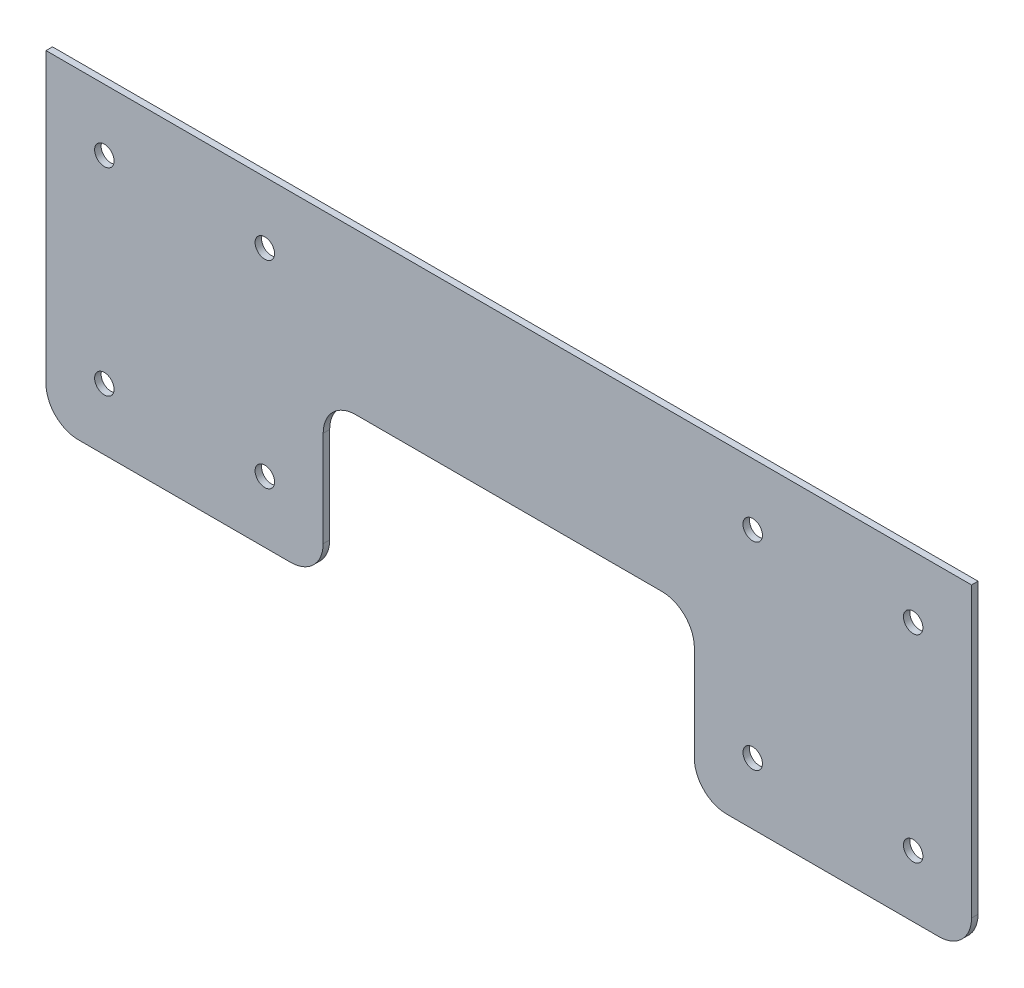
ISO-10303-21;
HEADER;
FILE_DESCRIPTION(('STEP AP214'),'2;1');
FILE_NAME('part.step','',(''),(''),'','','');
FILE_SCHEMA(('AUTOMOTIVE_DESIGN { 1 0 10303 214 1 1 1 1 }'));
ENDSEC;
DATA;
#1=APPLICATION_CONTEXT('core data for automotive mechanical design processes');
#2=APPLICATION_PROTOCOL_DEFINITION('international standard','automotive_design',2000,#1);
#3=PRODUCT_CONTEXT('',#1,'mechanical');
#4=PRODUCT('Part','Part','',(#3));
#5=PRODUCT_RELATED_PRODUCT_CATEGORY('part','',(#4));
#6=PRODUCT_DEFINITION_FORMATION('','',#4);
#7=PRODUCT_DEFINITION_CONTEXT('part definition',#1,'design');
#8=PRODUCT_DEFINITION('design','',#6,#7);
#9=PRODUCT_DEFINITION_SHAPE('','',#8);
#10=(LENGTH_UNIT() NAMED_UNIT(*) SI_UNIT(.MILLI.,.METRE.));
#11=(NAMED_UNIT(*) PLANE_ANGLE_UNIT() SI_UNIT($,.RADIAN.));
#12=(NAMED_UNIT(*) SI_UNIT($,.STERADIAN.) SOLID_ANGLE_UNIT());
#13=UNCERTAINTY_MEASURE_WITH_UNIT(LENGTH_MEASURE(1.E-05),#10,'distance_accuracy_value','');
#14=(GEOMETRIC_REPRESENTATION_CONTEXT(3) GLOBAL_UNCERTAINTY_ASSIGNED_CONTEXT((#13)) GLOBAL_UNIT_ASSIGNED_CONTEXT((#10,
#11,#12)) REPRESENTATION_CONTEXT('',''));
#15=CARTESIAN_POINT('',(0.,0.,0.));
#16=DIRECTION('',(0.,0.,1.));
#17=DIRECTION('',(1.,0.,0.));
#18=AXIS2_PLACEMENT_3D('',#15,#16,#17);
#19=CARTESIAN_POINT('',(132.75,-39.5,2.));
#20=DIRECTION('',(0.,0.,-1.));
#21=DIRECTION('',(-1.,0.,0.));
#22=AXIS2_PLACEMENT_3D('',#19,#20,#21);
#23=PLANE('',#22);
#24=DIRECTION('',(-1.,0.,0.));
#25=VECTOR('',#24,1.);
#26=CARTESIAN_POINT('',(-142.75,49.5,2.));
#27=LINE('',#26,#25);
#28=CARTESIAN_POINT('',(142.75,49.5,2.));
#29=VERTEX_POINT('',#28);
#30=CARTESIAN_POINT('',(-142.75,49.5,2.));
#31=VERTEX_POINT('',#30);
#32=EDGE_CURVE('E192',#29,#31,#27,.T.);
#33=ORIENTED_EDGE('',*,*,#32,.T.);
#34=DIRECTION('',(0.,-1.,0.));
#35=VECTOR('',#34,1.);
#36=CARTESIAN_POINT('',(-142.75,49.5,2.));
#37=LINE('',#36,#35);
#38=CARTESIAN_POINT('',(-142.75,-39.4999999999999,2.));
#39=VERTEX_POINT('',#38);
#40=EDGE_CURVE('E110',#31,#39,#37,.T.);
#41=ORIENTED_EDGE('',*,*,#40,.T.);
#42=CARTESIAN_POINT('',(-132.75,-39.5,2.));
#43=DIRECTION('',(0.,0.,1.));
#44=DIRECTION('',(1.,0.,0.));
#45=AXIS2_PLACEMENT_3D('',#42,#43,#44);
#46=CIRCLE('',#45,10.);
#47=CARTESIAN_POINT('',(-132.75,-49.5,2.));
#48=VERTEX_POINT('',#47);
#49=EDGE_CURVE('E225',#39,#48,#46,.T.);
#50=ORIENTED_EDGE('',*,*,#49,.T.);
#51=DIRECTION('',(1.,0.,0.));
#52=VECTOR('',#51,1.);
#53=CARTESIAN_POINT('',(-132.75,-49.5,2.));
#54=LINE('',#53,#52);
#55=CARTESIAN_POINT('',(-67.2500000000001,-49.5,2.));
#56=VERTEX_POINT('',#55);
#57=EDGE_CURVE('E244',#48,#56,#54,.T.);
#58=ORIENTED_EDGE('',*,*,#57,.T.);
#59=CARTESIAN_POINT('',(-67.25,-39.5,2.));
#60=DIRECTION('',(0.,0.,1.));
#61=DIRECTION('',(1.,0.,0.));
#62=AXIS2_PLACEMENT_3D('',#59,#60,#61);
#63=CIRCLE('',#62,10.);
#64=CARTESIAN_POINT('',(-57.25,-39.5,2.));
#65=VERTEX_POINT('',#64);
#66=EDGE_CURVE('E241',#56,#65,#63,.T.);
#67=ORIENTED_EDGE('',*,*,#66,.T.);
#68=DIRECTION('',(0.,1.,0.));
#69=VECTOR('',#68,1.);
#70=CARTESIAN_POINT('',(-57.25,-39.4999999999999,2.));
#71=LINE('',#70,#69);
#72=CARTESIAN_POINT('',(-57.25,-10.0000000000001,2.));
#73=VERTEX_POINT('',#72);
#74=EDGE_CURVE('E243',#65,#73,#71,.T.);
#75=ORIENTED_EDGE('',*,*,#74,.T.);
#76=CARTESIAN_POINT('',(-47.25,-10.,2.));
#77=DIRECTION('',(0.,0.,-1.));
#78=DIRECTION('',(-1.,0.,0.));
#79=AXIS2_PLACEMENT_3D('',#76,#77,#78);
#80=CIRCLE('',#79,10.);
#81=CARTESIAN_POINT('',(-47.2499999999999,0.,2.));
#82=VERTEX_POINT('',#81);
#83=EDGE_CURVE('E246',#73,#82,#80,.T.);
#84=ORIENTED_EDGE('',*,*,#83,.T.);
#85=DIRECTION('',(1.,0.,0.));
#86=VECTOR('',#85,1.);
#87=CARTESIAN_POINT('',(-47.2499999999999,0.,2.));
#88=LINE('',#87,#86);
#89=CARTESIAN_POINT('',(47.2499999999999,0.,2.));
#90=VERTEX_POINT('',#89);
#91=EDGE_CURVE('E252',#82,#90,#88,.T.);
#92=ORIENTED_EDGE('',*,*,#91,.T.);
#93=CARTESIAN_POINT('',(47.25,-10.,2.));
#94=DIRECTION('',(0.,0.,-1.));
#95=DIRECTION('',(-1.,0.,0.));
#96=AXIS2_PLACEMENT_3D('',#93,#94,#95);
#97=CIRCLE('',#96,10.);
#98=CARTESIAN_POINT('',(57.25,-10.0000000000001,2.));
#99=VERTEX_POINT('',#98);
#100=EDGE_CURVE('E254',#90,#99,#97,.T.);
#101=ORIENTED_EDGE('',*,*,#100,.T.);
#102=DIRECTION('',(0.,-1.,0.));
#103=VECTOR('',#102,1.);
#104=CARTESIAN_POINT('',(57.25,-10.0000000000001,2.));
#105=LINE('',#104,#103);
#106=CARTESIAN_POINT('',(57.25,-39.4999999999999,2.));
#107=VERTEX_POINT('',#106);
#108=EDGE_CURVE('E256',#99,#107,#105,.T.);
#109=ORIENTED_EDGE('',*,*,#108,.T.);
#110=CARTESIAN_POINT('',(67.25,-39.5,2.));
#111=DIRECTION('',(0.,0.,1.));
#112=DIRECTION('',(1.,0.,0.));
#113=AXIS2_PLACEMENT_3D('',#110,#111,#112);
#114=CIRCLE('',#113,9.99999999999999);
#115=CARTESIAN_POINT('',(67.2500000000001,-49.5,2.));
#116=VERTEX_POINT('',#115);
#117=EDGE_CURVE('E147',#107,#116,#114,.T.);
#118=ORIENTED_EDGE('',*,*,#117,.T.);
#119=DIRECTION('',(1.,0.,0.));
#120=VECTOR('',#119,1.);
#121=CARTESIAN_POINT('',(132.75,-49.5,2.));
#122=LINE('',#121,#120);
#123=CARTESIAN_POINT('',(132.75,-49.5,2.));
#124=VERTEX_POINT('',#123);
#125=EDGE_CURVE('E141',#116,#124,#122,.T.);
#126=ORIENTED_EDGE('',*,*,#125,.T.);
#127=CARTESIAN_POINT('',(132.75,-39.5,2.));
#128=DIRECTION('',(0.,0.,1.));
#129=DIRECTION('',(-1.,0.,0.));
#130=AXIS2_PLACEMENT_3D('',#127,#128,#129);
#131=CIRCLE('',#130,10.);
#132=CARTESIAN_POINT('',(142.75,-39.4999999999999,2.));
#133=VERTEX_POINT('',#132);
#134=EDGE_CURVE('E145',#124,#133,#131,.T.);
#135=ORIENTED_EDGE('',*,*,#134,.T.);
#136=DIRECTION('',(0.,1.,0.));
#137=VECTOR('',#136,1.);
#138=CARTESIAN_POINT('',(142.75,49.5,2.));
#139=LINE('',#138,#137);
#140=EDGE_CURVE('E49',#133,#29,#139,.T.);
#141=ORIENTED_EDGE('',*,*,#140,.T.);
#142=EDGE_LOOP('',(#33,#41,#50,#58,#67,#75,#84,#92,#101,#109,#118,#126,#135,#141));
#143=FACE_BOUND('',#142,.T.);
#144=CARTESIAN_POINT('',(124.75,30.5,2.));
#145=DIRECTION('',(0.,0.,1.));
#146=DIRECTION('',(1.,0.,0.));
#147=AXIS2_PLACEMENT_3D('',#144,#145,#146);
#148=CIRCLE('',#147,2.99999999999998);
#149=CARTESIAN_POINT('',(127.75,30.5,2.));
#150=VERTEX_POINT('',#149);
#151=EDGE_CURVE('E169',#150,#150,#148,.T.);
#152=ORIENTED_EDGE('',*,*,#151,.F.);
#153=EDGE_LOOP('',(#152));
#154=FACE_BOUND('',#153,.T.);
#155=CARTESIAN_POINT('',(124.75,-30.5,2.));
#156=DIRECTION('',(0.,0.,1.));
#157=DIRECTION('',(1.,0.,0.));
#158=AXIS2_PLACEMENT_3D('',#155,#156,#157);
#159=CIRCLE('',#158,2.99999999999997);
#160=CARTESIAN_POINT('',(127.75,-30.5,2.));
#161=VERTEX_POINT('',#160);
#162=EDGE_CURVE('E360',#161,#161,#159,.T.);
#163=ORIENTED_EDGE('',*,*,#162,.F.);
#164=EDGE_LOOP('',(#163));
#165=FACE_BOUND('',#164,.T.);
#166=CARTESIAN_POINT('',(-75.25,-30.5,2.));
#167=DIRECTION('',(0.,0.,1.));
#168=DIRECTION('',(1.,0.,0.));
#169=AXIS2_PLACEMENT_3D('',#166,#167,#168);
#170=CIRCLE('',#169,2.99999999999999);
#171=CARTESIAN_POINT('',(-72.25,-30.5,2.));
#172=VERTEX_POINT('',#171);
#173=EDGE_CURVE('E354',#172,#172,#170,.T.);
#174=ORIENTED_EDGE('',*,*,#173,.F.);
#175=EDGE_LOOP('',(#174));
#176=FACE_BOUND('',#175,.T.);
#177=CARTESIAN_POINT('',(-75.25,30.5,2.));
#178=DIRECTION('',(0.,0.,1.));
#179=DIRECTION('',(1.,0.,0.));
#180=AXIS2_PLACEMENT_3D('',#177,#178,#179);
#181=CIRCLE('',#180,2.99999999999999);
#182=CARTESIAN_POINT('',(-72.25,30.5,2.));
#183=VERTEX_POINT('',#182);
#184=EDGE_CURVE('E348',#183,#183,#181,.T.);
#185=ORIENTED_EDGE('',*,*,#184,.F.);
#186=EDGE_LOOP('',(#185));
#187=FACE_BOUND('',#186,.T.);
#188=CARTESIAN_POINT('',(75.25,-30.5,2.));
#189=DIRECTION('',(0.,0.,1.));
#190=DIRECTION('',(-1.,0.,0.));
#191=AXIS2_PLACEMENT_3D('',#188,#189,#190);
#192=CIRCLE('',#191,2.99999999999999);
#193=CARTESIAN_POINT('',(72.25,-30.5,2.));
#194=VERTEX_POINT('',#193);
#195=EDGE_CURVE('E342',#194,#194,#192,.T.);
#196=ORIENTED_EDGE('',*,*,#195,.F.);
#197=EDGE_LOOP('',(#196));
#198=FACE_BOUND('',#197,.T.);
#199=CARTESIAN_POINT('',(75.25,30.5,2.));
#200=DIRECTION('',(0.,0.,1.));
#201=DIRECTION('',(-1.,0.,0.));
#202=AXIS2_PLACEMENT_3D('',#199,#200,#201);
#203=CIRCLE('',#202,2.99999999999999);
#204=CARTESIAN_POINT('',(72.25,30.5,2.));
#205=VERTEX_POINT('',#204);
#206=EDGE_CURVE('E336',#205,#205,#203,.T.);
#207=ORIENTED_EDGE('',*,*,#206,.F.);
#208=EDGE_LOOP('',(#207));
#209=FACE_BOUND('',#208,.T.);
#210=CARTESIAN_POINT('',(-124.75,30.5,2.));
#211=DIRECTION('',(0.,0.,1.));
#212=DIRECTION('',(-1.,0.,0.));
#213=AXIS2_PLACEMENT_3D('',#210,#211,#212);
#214=CIRCLE('',#213,2.99999999999998);
#215=CARTESIAN_POINT('',(-127.75,30.5,2.));
#216=VERTEX_POINT('',#215);
#217=EDGE_CURVE('E330',#216,#216,#214,.T.);
#218=ORIENTED_EDGE('',*,*,#217,.F.);
#219=EDGE_LOOP('',(#218));
#220=FACE_BOUND('',#219,.T.);
#221=CARTESIAN_POINT('',(-124.75,-30.5,2.));
#222=DIRECTION('',(0.,0.,1.));
#223=DIRECTION('',(-1.,0.,0.));
#224=AXIS2_PLACEMENT_3D('',#221,#222,#223);
#225=CIRCLE('',#224,2.99999999999997);
#226=CARTESIAN_POINT('',(-127.75,-30.5,2.));
#227=VERTEX_POINT('',#226);
#228=EDGE_CURVE('E321',#227,#227,#225,.T.);
#229=ORIENTED_EDGE('',*,*,#228,.F.);
#230=EDGE_LOOP('',(#229));
#231=FACE_BOUND('',#230,.T.);
#232=ADVANCED_FACE('F32',(#143,#154,#165,#176,#187,#198,#209,#220,#231),#23,.F.);
#233=CARTESIAN_POINT('',(132.75,-39.5,0.));
#234=DIRECTION('',(0.,0.,-1.));
#235=DIRECTION('',(-1.,0.,0.));
#236=AXIS2_PLACEMENT_3D('',#233,#234,#235);
#237=PLANE('',#236);
#238=CARTESIAN_POINT('',(-124.75,30.5,0.));
#239=DIRECTION('',(0.,0.,1.));
#240=DIRECTION('',(-1.,0.,0.));
#241=AXIS2_PLACEMENT_3D('',#238,#239,#240);
#242=CIRCLE('',#241,2.99999999999998);
#243=CARTESIAN_POINT('',(-127.75,30.5,0.));
#244=VERTEX_POINT('',#243);
#245=EDGE_CURVE('E327',#244,#244,#242,.T.);
#246=ORIENTED_EDGE('',*,*,#245,.T.);
#247=EDGE_LOOP('',(#246));
#248=FACE_BOUND('',#247,.T.);
#249=CARTESIAN_POINT('',(75.25,-30.5,0.));
#250=DIRECTION('',(0.,0.,1.));
#251=DIRECTION('',(-1.,0.,0.));
#252=AXIS2_PLACEMENT_3D('',#249,#250,#251);
#253=CIRCLE('',#252,2.99999999999999);
#254=CARTESIAN_POINT('',(72.25,-30.5,0.));
#255=VERTEX_POINT('',#254);
#256=EDGE_CURVE('E339',#255,#255,#253,.T.);
#257=ORIENTED_EDGE('',*,*,#256,.T.);
#258=EDGE_LOOP('',(#257));
#259=FACE_BOUND('',#258,.T.);
#260=CARTESIAN_POINT('',(-75.25,-30.5,0.));
#261=DIRECTION('',(0.,0.,1.));
#262=DIRECTION('',(1.,0.,0.));
#263=AXIS2_PLACEMENT_3D('',#260,#261,#262);
#264=CIRCLE('',#263,2.99999999999999);
#265=CARTESIAN_POINT('',(-72.25,-30.5,0.));
#266=VERTEX_POINT('',#265);
#267=EDGE_CURVE('E351',#266,#266,#264,.T.);
#268=ORIENTED_EDGE('',*,*,#267,.T.);
#269=EDGE_LOOP('',(#268));
#270=FACE_BOUND('',#269,.T.);
#271=CARTESIAN_POINT('',(124.75,30.5,0.));
#272=DIRECTION('',(0.,0.,1.));
#273=DIRECTION('',(1.,0.,0.));
#274=AXIS2_PLACEMENT_3D('',#271,#272,#273);
#275=CIRCLE('',#274,2.99999999999998);
#276=CARTESIAN_POINT('',(127.75,30.5,0.));
#277=VERTEX_POINT('',#276);
#278=EDGE_CURVE('E363',#277,#277,#275,.T.);
#279=ORIENTED_EDGE('',*,*,#278,.T.);
#280=EDGE_LOOP('',(#279));
#281=FACE_BOUND('',#280,.T.);
#282=DIRECTION('',(-1.,0.,0.));
#283=VECTOR('',#282,1.);
#284=CARTESIAN_POINT('',(-142.75,49.5,0.));
#285=LINE('',#284,#283);
#286=CARTESIAN_POINT('',(142.75,49.5,0.));
#287=VERTEX_POINT('',#286);
#288=CARTESIAN_POINT('',(-142.75,49.5,0.));
#289=VERTEX_POINT('',#288);
#290=EDGE_CURVE('E165',#287,#289,#285,.T.);
#291=ORIENTED_EDGE('',*,*,#290,.F.);
#292=DIRECTION('',(0.,1.,0.));
#293=VECTOR('',#292,1.);
#294=CARTESIAN_POINT('',(142.75,49.5,0.));
#295=LINE('',#294,#293);
#296=CARTESIAN_POINT('',(142.75,-39.4999999999999,0.));
#297=VERTEX_POINT('',#296);
#298=EDGE_CURVE('E102',#297,#287,#295,.T.);
#299=ORIENTED_EDGE('',*,*,#298,.F.);
#300=CARTESIAN_POINT('',(132.75,-39.5,0.));
#301=DIRECTION('',(0.,0.,1.));
#302=DIRECTION('',(-1.,0.,0.));
#303=AXIS2_PLACEMENT_3D('',#300,#301,#302);
#304=CIRCLE('',#303,10.);
#305=CARTESIAN_POINT('',(132.75,-49.5,0.));
#306=VERTEX_POINT('',#305);
#307=EDGE_CURVE('E96',#306,#297,#304,.T.);
#308=ORIENTED_EDGE('',*,*,#307,.F.);
#309=DIRECTION('',(1.,0.,0.));
#310=VECTOR('',#309,1.);
#311=CARTESIAN_POINT('',(132.75,-49.5,0.));
#312=LINE('',#311,#310);
#313=CARTESIAN_POINT('',(67.2500000000001,-49.5,0.));
#314=VERTEX_POINT('',#313);
#315=EDGE_CURVE('E155',#314,#306,#312,.T.);
#316=ORIENTED_EDGE('',*,*,#315,.F.);
#317=CARTESIAN_POINT('',(67.25,-39.5,0.));
#318=DIRECTION('',(0.,0.,1.));
#319=DIRECTION('',(1.,0.,0.));
#320=AXIS2_PLACEMENT_3D('',#317,#318,#319);
#321=CIRCLE('',#320,9.99999999999999);
#322=CARTESIAN_POINT('',(57.25,-39.4999999999999,0.));
#323=VERTEX_POINT('',#322);
#324=EDGE_CURVE('E187',#323,#314,#321,.T.);
#325=ORIENTED_EDGE('',*,*,#324,.F.);
#326=DIRECTION('',(0.,-1.,0.));
#327=VECTOR('',#326,1.);
#328=CARTESIAN_POINT('',(57.25,-10.0000000000001,0.));
#329=LINE('',#328,#327);
#330=CARTESIAN_POINT('',(57.25,-10.0000000000001,0.));
#331=VERTEX_POINT('',#330);
#332=EDGE_CURVE('E185',#331,#323,#329,.T.);
#333=ORIENTED_EDGE('',*,*,#332,.F.);
#334=CARTESIAN_POINT('',(47.25,-10.,0.));
#335=DIRECTION('',(0.,0.,-1.));
#336=DIRECTION('',(-1.,0.,0.));
#337=AXIS2_PLACEMENT_3D('',#334,#335,#336);
#338=CIRCLE('',#337,10.);
#339=CARTESIAN_POINT('',(47.2499999999999,0.,0.));
#340=VERTEX_POINT('',#339);
#341=EDGE_CURVE('E183',#340,#331,#338,.T.);
#342=ORIENTED_EDGE('',*,*,#341,.F.);
#343=DIRECTION('',(1.,0.,0.));
#344=VECTOR('',#343,1.);
#345=CARTESIAN_POINT('',(-47.2499999999999,0.,0.));
#346=LINE('',#345,#344);
#347=CARTESIAN_POINT('',(-47.2499999999999,0.,0.));
#348=VERTEX_POINT('',#347);
#349=EDGE_CURVE('E181',#348,#340,#346,.T.);
#350=ORIENTED_EDGE('',*,*,#349,.F.);
#351=CARTESIAN_POINT('',(-47.25,-10.,0.));
#352=DIRECTION('',(0.,0.,-1.));
#353=DIRECTION('',(-1.,0.,0.));
#354=AXIS2_PLACEMENT_3D('',#351,#352,#353);
#355=CIRCLE('',#354,10.);
#356=CARTESIAN_POINT('',(-57.25,-10.0000000000001,0.));
#357=VERTEX_POINT('',#356);
#358=EDGE_CURVE('E179',#357,#348,#355,.T.);
#359=ORIENTED_EDGE('',*,*,#358,.F.);
#360=DIRECTION('',(0.,1.,0.));
#361=VECTOR('',#360,1.);
#362=CARTESIAN_POINT('',(-57.25,-39.4999999999999,0.));
#363=LINE('',#362,#361);
#364=CARTESIAN_POINT('',(-57.25,-39.5,0.));
#365=VERTEX_POINT('',#364);
#366=EDGE_CURVE('E177',#365,#357,#363,.T.);
#367=ORIENTED_EDGE('',*,*,#366,.F.);
#368=CARTESIAN_POINT('',(-67.25,-39.5,0.));
#369=DIRECTION('',(0.,0.,1.));
#370=DIRECTION('',(1.,0.,0.));
#371=AXIS2_PLACEMENT_3D('',#368,#369,#370);
#372=CIRCLE('',#371,10.);
#373=CARTESIAN_POINT('',(-67.2500000000001,-49.5,0.));
#374=VERTEX_POINT('',#373);
#375=EDGE_CURVE('E175',#374,#365,#372,.T.);
#376=ORIENTED_EDGE('',*,*,#375,.F.);
#377=DIRECTION('',(1.,0.,0.));
#378=VECTOR('',#377,1.);
#379=CARTESIAN_POINT('',(-132.75,-49.5,0.));
#380=LINE('',#379,#378);
#381=CARTESIAN_POINT('',(-132.75,-49.5,0.));
#382=VERTEX_POINT('',#381);
#383=EDGE_CURVE('E173',#382,#374,#380,.T.);
#384=ORIENTED_EDGE('',*,*,#383,.F.);
#385=CARTESIAN_POINT('',(-132.75,-39.5,0.));
#386=DIRECTION('',(0.,0.,1.));
#387=DIRECTION('',(1.,0.,0.));
#388=AXIS2_PLACEMENT_3D('',#385,#386,#387);
#389=CIRCLE('',#388,10.);
#390=CARTESIAN_POINT('',(-142.75,-39.4999999999999,0.));
#391=VERTEX_POINT('',#390);
#392=EDGE_CURVE('E171',#391,#382,#389,.T.);
#393=ORIENTED_EDGE('',*,*,#392,.F.);
#394=DIRECTION('',(0.,-1.,0.));
#395=VECTOR('',#394,1.);
#396=CARTESIAN_POINT('',(-142.75,49.5,0.));
#397=LINE('',#396,#395);
#398=EDGE_CURVE('E168',#289,#391,#397,.T.);
#399=ORIENTED_EDGE('',*,*,#398,.F.);
#400=EDGE_LOOP('',(#291,#299,#308,#316,#325,#333,#342,#350,#359,#367,#376,#384,#393,#399));
#401=FACE_BOUND('',#400,.T.);
#402=CARTESIAN_POINT('',(124.75,-30.5,0.));
#403=DIRECTION('',(0.,0.,1.));
#404=DIRECTION('',(1.,0.,0.));
#405=AXIS2_PLACEMENT_3D('',#402,#403,#404);
#406=CIRCLE('',#405,2.99999999999997);
#407=CARTESIAN_POINT('',(127.75,-30.5,0.));
#408=VERTEX_POINT('',#407);
#409=EDGE_CURVE('E357',#408,#408,#406,.T.);
#410=ORIENTED_EDGE('',*,*,#409,.T.);
#411=EDGE_LOOP('',(#410));
#412=FACE_BOUND('',#411,.T.);
#413=CARTESIAN_POINT('',(-75.25,30.5,0.));
#414=DIRECTION('',(0.,0.,1.));
#415=DIRECTION('',(1.,0.,0.));
#416=AXIS2_PLACEMENT_3D('',#413,#414,#415);
#417=CIRCLE('',#416,2.99999999999999);
#418=CARTESIAN_POINT('',(-72.25,30.5,0.));
#419=VERTEX_POINT('',#418);
#420=EDGE_CURVE('E345',#419,#419,#417,.T.);
#421=ORIENTED_EDGE('',*,*,#420,.T.);
#422=EDGE_LOOP('',(#421));
#423=FACE_BOUND('',#422,.T.);
#424=CARTESIAN_POINT('',(75.25,30.5,0.));
#425=DIRECTION('',(0.,0.,1.));
#426=DIRECTION('',(-1.,0.,0.));
#427=AXIS2_PLACEMENT_3D('',#424,#425,#426);
#428=CIRCLE('',#427,2.99999999999999);
#429=CARTESIAN_POINT('',(72.25,30.5,0.));
#430=VERTEX_POINT('',#429);
#431=EDGE_CURVE('E333',#430,#430,#428,.T.);
#432=ORIENTED_EDGE('',*,*,#431,.T.);
#433=EDGE_LOOP('',(#432));
#434=FACE_BOUND('',#433,.T.);
#435=CARTESIAN_POINT('',(-124.75,-30.5,0.));
#436=DIRECTION('',(0.,0.,1.));
#437=DIRECTION('',(-1.,0.,0.));
#438=AXIS2_PLACEMENT_3D('',#435,#436,#437);
#439=CIRCLE('',#438,2.99999999999997);
#440=CARTESIAN_POINT('',(-127.75,-30.5,0.));
#441=VERTEX_POINT('',#440);
#442=EDGE_CURVE('E324',#441,#441,#439,.T.);
#443=ORIENTED_EDGE('',*,*,#442,.T.);
#444=EDGE_LOOP('',(#443));
#445=FACE_BOUND('',#444,.T.);
#446=ADVANCED_FACE('F229',(#248,#259,#270,#281,#401,#412,#423,#434,#445),#237,.T.);
#447=CARTESIAN_POINT('',(-142.75,49.5,2.));
#448=DIRECTION('',(0.,-1.,0.));
#449=DIRECTION('',(1.,0.,0.));
#450=AXIS2_PLACEMENT_3D('',#447,#448,#449);
#451=PLANE('',#450);
#452=ORIENTED_EDGE('',*,*,#290,.T.);
#453=DIRECTION('',(0.,0.,-1.));
#454=VECTOR('',#453,1.);
#455=CARTESIAN_POINT('',(-142.75,49.5,2.));
#456=LINE('',#455,#454);
#457=EDGE_CURVE('E11',#31,#289,#456,.T.);
#458=ORIENTED_EDGE('',*,*,#457,.F.);
#459=ORIENTED_EDGE('',*,*,#32,.F.);
#460=DIRECTION('',(0.,0.,-1.));
#461=VECTOR('',#460,1.);
#462=CARTESIAN_POINT('',(142.75,49.5,2.));
#463=LINE('',#462,#461);
#464=EDGE_CURVE('E161',#29,#287,#463,.T.);
#465=ORIENTED_EDGE('',*,*,#464,.T.);
#466=EDGE_LOOP('',(#452,#458,#459,#465));
#467=FACE_BOUND('',#466,.T.);
#468=ADVANCED_FACE('F34',(#467),#451,.F.);
#469=CARTESIAN_POINT('',(-142.75,49.5,2.));
#470=DIRECTION('',(1.,0.,0.));
#471=DIRECTION('',(0.,0.,-1.));
#472=AXIS2_PLACEMENT_3D('',#469,#470,#471);
#473=PLANE('',#472);
#474=ORIENTED_EDGE('',*,*,#398,.T.);
#475=DIRECTION('',(0.,0.,-1.));
#476=VECTOR('',#475,1.);
#477=CARTESIAN_POINT('',(-142.75,-39.4999999999999,2.));
#478=LINE('',#477,#476);
#479=EDGE_CURVE('E41',#39,#391,#478,.T.);
#480=ORIENTED_EDGE('',*,*,#479,.F.);
#481=ORIENTED_EDGE('',*,*,#40,.F.);
#482=ORIENTED_EDGE('',*,*,#457,.T.);
#483=EDGE_LOOP('',(#474,#480,#481,#482));
#484=FACE_BOUND('',#483,.T.);
#485=ADVANCED_FACE('F531',(#484),#473,.F.);
#486=CARTESIAN_POINT('',(-132.75,-39.5,2.));
#487=DIRECTION('',(0.,0.,-1.));
#488=DIRECTION('',(-1.,0.,0.));
#489=AXIS2_PLACEMENT_3D('',#486,#487,#488);
#490=CYLINDRICAL_SURFACE('',#489,10.);
#491=ORIENTED_EDGE('',*,*,#392,.T.);
#492=DIRECTION('',(0.,0.,-1.));
#493=VECTOR('',#492,1.);
#494=CARTESIAN_POINT('',(-132.75,-49.5,2.));
#495=LINE('',#494,#493);
#496=EDGE_CURVE('E217',#48,#382,#495,.T.);
#497=ORIENTED_EDGE('',*,*,#496,.F.);
#498=ORIENTED_EDGE('',*,*,#49,.F.);
#499=ORIENTED_EDGE('',*,*,#479,.T.);
#500=EDGE_LOOP('',(#491,#497,#498,#499));
#501=FACE_BOUND('',#500,.T.);
#502=ADVANCED_FACE('F223',(#501),#490,.T.);
#503=CARTESIAN_POINT('',(-132.75,-49.5,2.));
#504=DIRECTION('',(0.,1.,0.));
#505=DIRECTION('',(0.,0.,1.));
#506=AXIS2_PLACEMENT_3D('',#503,#504,#505);
#507=PLANE('',#506);
#508=ORIENTED_EDGE('',*,*,#383,.T.);
#509=DIRECTION('',(0.,0.,-1.));
#510=VECTOR('',#509,1.);
#511=CARTESIAN_POINT('',(-67.2500000000001,-49.5,2.));
#512=LINE('',#511,#510);
#513=EDGE_CURVE('E214',#56,#374,#512,.T.);
#514=ORIENTED_EDGE('',*,*,#513,.F.);
#515=ORIENTED_EDGE('',*,*,#57,.F.);
#516=ORIENTED_EDGE('',*,*,#496,.T.);
#517=EDGE_LOOP('',(#508,#514,#515,#516));
#518=FACE_BOUND('',#517,.T.);
#519=ADVANCED_FACE('F235',(#518),#507,.F.);
#520=CARTESIAN_POINT('',(-67.25,-39.5,2.));
#521=DIRECTION('',(0.,0.,-1.));
#522=DIRECTION('',(-1.,0.,0.));
#523=AXIS2_PLACEMENT_3D('',#520,#521,#522);
#524=CYLINDRICAL_SURFACE('',#523,10.);
#525=ORIENTED_EDGE('',*,*,#375,.T.);
#526=DIRECTION('',(0.,0.,-1.));
#527=VECTOR('',#526,1.);
#528=CARTESIAN_POINT('',(-57.25,-39.5,2.));
#529=LINE('',#528,#527);
#530=EDGE_CURVE('E211',#65,#365,#529,.T.);
#531=ORIENTED_EDGE('',*,*,#530,.F.);
#532=ORIENTED_EDGE('',*,*,#66,.F.);
#533=ORIENTED_EDGE('',*,*,#513,.T.);
#534=EDGE_LOOP('',(#525,#531,#532,#533));
#535=FACE_BOUND('',#534,.T.);
#536=ADVANCED_FACE('F239',(#535),#524,.T.);
#537=CARTESIAN_POINT('',(-57.25,-39.4999999999999,2.));
#538=DIRECTION('',(-1.,0.,0.));
#539=DIRECTION('',(0.,0.,1.));
#540=AXIS2_PLACEMENT_3D('',#537,#538,#539);
#541=PLANE('',#540);
#542=ORIENTED_EDGE('',*,*,#366,.T.);
#543=DIRECTION('',(0.,0.,-1.));
#544=VECTOR('',#543,1.);
#545=CARTESIAN_POINT('',(-57.25,-10.0000000000001,2.));
#546=LINE('',#545,#544);
#547=EDGE_CURVE('E208',#73,#357,#546,.T.);
#548=ORIENTED_EDGE('',*,*,#547,.F.);
#549=ORIENTED_EDGE('',*,*,#74,.F.);
#550=ORIENTED_EDGE('',*,*,#530,.T.);
#551=EDGE_LOOP('',(#542,#548,#549,#550));
#552=FACE_BOUND('',#551,.T.);
#553=ADVANCED_FACE('F496',(#552),#541,.F.);
#554=CARTESIAN_POINT('',(-47.25,-10.,2.));
#555=DIRECTION('',(0.,0.,-1.));
#556=DIRECTION('',(-1.,0.,0.));
#557=AXIS2_PLACEMENT_3D('',#554,#555,#556);
#558=CYLINDRICAL_SURFACE('',#557,10.);
#559=ORIENTED_EDGE('',*,*,#358,.T.);
#560=DIRECTION('',(0.,0.,-1.));
#561=VECTOR('',#560,1.);
#562=CARTESIAN_POINT('',(-47.2499999999999,0.,2.));
#563=LINE('',#562,#561);
#564=EDGE_CURVE('E205',#82,#348,#563,.T.);
#565=ORIENTED_EDGE('',*,*,#564,.F.);
#566=ORIENTED_EDGE('',*,*,#83,.F.);
#567=ORIENTED_EDGE('',*,*,#547,.T.);
#568=EDGE_LOOP('',(#559,#565,#566,#567));
#569=FACE_BOUND('',#568,.T.);
#570=ADVANCED_FACE('F486',(#569),#558,.F.);
#571=CARTESIAN_POINT('',(-47.2499999999999,0.,2.));
#572=DIRECTION('',(0.,1.,0.));
#573=DIRECTION('',(0.,0.,1.));
#574=AXIS2_PLACEMENT_3D('',#571,#572,#573);
#575=PLANE('',#574);
#576=ORIENTED_EDGE('',*,*,#349,.T.);
#577=DIRECTION('',(0.,0.,-1.));
#578=VECTOR('',#577,1.);
#579=CARTESIAN_POINT('',(47.2499999999999,0.,2.));
#580=LINE('',#579,#578);
#581=EDGE_CURVE('E202',#90,#340,#580,.T.);
#582=ORIENTED_EDGE('',*,*,#581,.F.);
#583=ORIENTED_EDGE('',*,*,#91,.F.);
#584=ORIENTED_EDGE('',*,*,#564,.T.);
#585=EDGE_LOOP('',(#576,#582,#583,#584));
#586=FACE_BOUND('',#585,.T.);
#587=ADVANCED_FACE('F476',(#586),#575,.F.);
#588=CARTESIAN_POINT('',(47.25,-10.,2.));
#589=DIRECTION('',(0.,0.,-1.));
#590=DIRECTION('',(-1.,0.,0.));
#591=AXIS2_PLACEMENT_3D('',#588,#589,#590);
#592=CYLINDRICAL_SURFACE('',#591,10.);
#593=ORIENTED_EDGE('',*,*,#341,.T.);
#594=DIRECTION('',(0.,0.,-1.));
#595=VECTOR('',#594,1.);
#596=CARTESIAN_POINT('',(57.25,-10.0000000000001,2.));
#597=LINE('',#596,#595);
#598=EDGE_CURVE('E199',#99,#331,#597,.T.);
#599=ORIENTED_EDGE('',*,*,#598,.F.);
#600=ORIENTED_EDGE('',*,*,#100,.F.);
#601=ORIENTED_EDGE('',*,*,#581,.T.);
#602=EDGE_LOOP('',(#593,#599,#600,#601));
#603=FACE_BOUND('',#602,.T.);
#604=ADVANCED_FACE('F467',(#603),#592,.F.);
#605=CARTESIAN_POINT('',(57.25,-10.0000000000001,2.));
#606=DIRECTION('',(1.,0.,0.));
#607=DIRECTION('',(0.,1.,0.));
#608=AXIS2_PLACEMENT_3D('',#605,#606,#607);
#609=PLANE('',#608);
#610=ORIENTED_EDGE('',*,*,#332,.T.);
#611=DIRECTION('',(0.,0.,-1.));
#612=VECTOR('',#611,1.);
#613=CARTESIAN_POINT('',(57.25,-39.4999999999999,2.));
#614=LINE('',#613,#612);
#615=EDGE_CURVE('E196',#107,#323,#614,.T.);
#616=ORIENTED_EDGE('',*,*,#615,.F.);
#617=ORIENTED_EDGE('',*,*,#108,.F.);
#618=ORIENTED_EDGE('',*,*,#598,.T.);
#619=EDGE_LOOP('',(#610,#616,#617,#618));
#620=FACE_BOUND('',#619,.T.);
#621=ADVANCED_FACE('F262',(#620),#609,.F.);
#622=CARTESIAN_POINT('',(67.25,-39.5,2.));
#623=DIRECTION('',(0.,0.,-1.));
#624=DIRECTION('',(-1.,0.,0.));
#625=AXIS2_PLACEMENT_3D('',#622,#623,#624);
#626=CYLINDRICAL_SURFACE('',#625,9.99999999999999);
#627=ORIENTED_EDGE('',*,*,#324,.T.);
#628=DIRECTION('',(0.,0.,-1.));
#629=VECTOR('',#628,1.);
#630=CARTESIAN_POINT('',(67.2500000000001,-49.5,2.));
#631=LINE('',#630,#629);
#632=EDGE_CURVE('E156',#116,#314,#631,.T.);
#633=ORIENTED_EDGE('',*,*,#632,.F.);
#634=ORIENTED_EDGE('',*,*,#117,.F.);
#635=ORIENTED_EDGE('',*,*,#615,.T.);
#636=EDGE_LOOP('',(#627,#633,#634,#635));
#637=FACE_BOUND('',#636,.T.);
#638=ADVANCED_FACE('F266',(#637),#626,.T.);
#639=CARTESIAN_POINT('',(132.75,-49.5,2.));
#640=DIRECTION('',(0.,1.,0.));
#641=DIRECTION('',(-1.,0.,0.));
#642=AXIS2_PLACEMENT_3D('',#639,#640,#641);
#643=PLANE('',#642);
#644=ORIENTED_EDGE('',*,*,#315,.T.);
#645=DIRECTION('',(0.,0.,-1.));
#646=VECTOR('',#645,1.);
#647=CARTESIAN_POINT('',(132.75,-49.5,2.));
#648=LINE('',#647,#646);
#649=EDGE_CURVE('E152',#124,#306,#648,.T.);
#650=ORIENTED_EDGE('',*,*,#649,.F.);
#651=ORIENTED_EDGE('',*,*,#125,.F.);
#652=ORIENTED_EDGE('',*,*,#632,.T.);
#653=EDGE_LOOP('',(#644,#650,#651,#652));
#654=FACE_BOUND('',#653,.T.);
#655=ADVANCED_FACE('F153',(#654),#643,.F.);
#656=CARTESIAN_POINT('',(132.75,-39.5,2.));
#657=DIRECTION('',(0.,0.,-1.));
#658=DIRECTION('',(-1.,0.,0.));
#659=AXIS2_PLACEMENT_3D('',#656,#657,#658);
#660=CYLINDRICAL_SURFACE('',#659,10.);
#661=ORIENTED_EDGE('',*,*,#307,.T.);
#662=DIRECTION('',(0.,0.,-1.));
#663=VECTOR('',#662,1.);
#664=CARTESIAN_POINT('',(142.75,-39.4999999999999,2.));
#665=LINE('',#664,#663);
#666=EDGE_CURVE('E157',#133,#297,#665,.T.);
#667=ORIENTED_EDGE('',*,*,#666,.F.);
#668=ORIENTED_EDGE('',*,*,#134,.F.);
#669=ORIENTED_EDGE('',*,*,#649,.T.);
#670=EDGE_LOOP('',(#661,#667,#668,#669));
#671=FACE_BOUND('',#670,.T.);
#672=ADVANCED_FACE('F159',(#671),#660,.T.);
#673=CARTESIAN_POINT('',(142.75,49.5,2.));
#674=DIRECTION('',(-1.,0.,0.));
#675=DIRECTION('',(0.,0.,1.));
#676=AXIS2_PLACEMENT_3D('',#673,#674,#675);
#677=PLANE('',#676);
#678=ORIENTED_EDGE('',*,*,#298,.T.);
#679=ORIENTED_EDGE('',*,*,#464,.F.);
#680=ORIENTED_EDGE('',*,*,#140,.F.);
#681=ORIENTED_EDGE('',*,*,#666,.T.);
#682=EDGE_LOOP('',(#678,#679,#680,#681));
#683=FACE_BOUND('',#682,.T.);
#684=ADVANCED_FACE('F270',(#683),#677,.F.);
#685=CARTESIAN_POINT('',(124.75,30.5,2.));
#686=DIRECTION('',(0.,0.,-1.));
#687=DIRECTION('',(-1.,0.,0.));
#688=AXIS2_PLACEMENT_3D('',#685,#686,#687);
#689=CYLINDRICAL_SURFACE('',#688,2.99999999999998);
#690=ORIENTED_EDGE('',*,*,#151,.T.);
#691=EDGE_LOOP('',(#690));
#692=FACE_BOUND('',#691,.T.);
#693=ORIENTED_EDGE('',*,*,#278,.F.);
#694=EDGE_LOOP('',(#693));
#695=FACE_BOUND('',#694,.T.);
#696=ADVANCED_FACE('F272',(#692,#695),#689,.F.);
#697=CARTESIAN_POINT('',(124.75,-30.5,2.));
#698=DIRECTION('',(0.,0.,-1.));
#699=DIRECTION('',(-1.,0.,0.));
#700=AXIS2_PLACEMENT_3D('',#697,#698,#699);
#701=CYLINDRICAL_SURFACE('',#700,2.99999999999997);
#702=ORIENTED_EDGE('',*,*,#162,.T.);
#703=EDGE_LOOP('',(#702));
#704=FACE_BOUND('',#703,.T.);
#705=ORIENTED_EDGE('',*,*,#409,.F.);
#706=EDGE_LOOP('',(#705));
#707=FACE_BOUND('',#706,.T.);
#708=ADVANCED_FACE('F278',(#704,#707),#701,.F.);
#709=CARTESIAN_POINT('',(-75.25,-30.5,2.));
#710=DIRECTION('',(0.,0.,-1.));
#711=DIRECTION('',(-1.,0.,0.));
#712=AXIS2_PLACEMENT_3D('',#709,#710,#711);
#713=CYLINDRICAL_SURFACE('',#712,2.99999999999999);
#714=ORIENTED_EDGE('',*,*,#173,.T.);
#715=EDGE_LOOP('',(#714));
#716=FACE_BOUND('',#715,.T.);
#717=ORIENTED_EDGE('',*,*,#267,.F.);
#718=EDGE_LOOP('',(#717));
#719=FACE_BOUND('',#718,.T.);
#720=ADVANCED_FACE('F292',(#716,#719),#713,.F.);
#721=CARTESIAN_POINT('',(-75.25,30.5,2.));
#722=DIRECTION('',(0.,0.,-1.));
#723=DIRECTION('',(-1.,0.,0.));
#724=AXIS2_PLACEMENT_3D('',#721,#722,#723);
#725=CYLINDRICAL_SURFACE('',#724,2.99999999999999);
#726=ORIENTED_EDGE('',*,*,#184,.T.);
#727=EDGE_LOOP('',(#726));
#728=FACE_BOUND('',#727,.T.);
#729=ORIENTED_EDGE('',*,*,#420,.F.);
#730=EDGE_LOOP('',(#729));
#731=FACE_BOUND('',#730,.T.);
#732=ADVANCED_FACE('F296',(#728,#731),#725,.F.);
#733=CARTESIAN_POINT('',(75.25,-30.5,2.));
#734=DIRECTION('',(0.,0.,-1.));
#735=DIRECTION('',(-1.,0.,0.));
#736=AXIS2_PLACEMENT_3D('',#733,#734,#735);
#737=CYLINDRICAL_SURFACE('',#736,2.99999999999999);
#738=ORIENTED_EDGE('',*,*,#195,.T.);
#739=EDGE_LOOP('',(#738));
#740=FACE_BOUND('',#739,.T.);
#741=ORIENTED_EDGE('',*,*,#256,.F.);
#742=EDGE_LOOP('',(#741));
#743=FACE_BOUND('',#742,.T.);
#744=ADVANCED_FACE('F300',(#740,#743),#737,.F.);
#745=CARTESIAN_POINT('',(75.25,30.5,2.));
#746=DIRECTION('',(0.,0.,-1.));
#747=DIRECTION('',(-1.,0.,0.));
#748=AXIS2_PLACEMENT_3D('',#745,#746,#747);
#749=CYLINDRICAL_SURFACE('',#748,2.99999999999999);
#750=ORIENTED_EDGE('',*,*,#206,.T.);
#751=EDGE_LOOP('',(#750));
#752=FACE_BOUND('',#751,.T.);
#753=ORIENTED_EDGE('',*,*,#431,.F.);
#754=EDGE_LOOP('',(#753));
#755=FACE_BOUND('',#754,.T.);
#756=ADVANCED_FACE('F304',(#752,#755),#749,.F.);
#757=CARTESIAN_POINT('',(-124.75,30.5,2.));
#758=DIRECTION('',(0.,0.,-1.));
#759=DIRECTION('',(-1.,0.,0.));
#760=AXIS2_PLACEMENT_3D('',#757,#758,#759);
#761=CYLINDRICAL_SURFACE('',#760,2.99999999999998);
#762=ORIENTED_EDGE('',*,*,#217,.T.);
#763=EDGE_LOOP('',(#762));
#764=FACE_BOUND('',#763,.T.);
#765=ORIENTED_EDGE('',*,*,#245,.F.);
#766=EDGE_LOOP('',(#765));
#767=FACE_BOUND('',#766,.T.);
#768=ADVANCED_FACE('F308',(#764,#767),#761,.F.);
#769=CARTESIAN_POINT('',(-124.75,-30.5,2.));
#770=DIRECTION('',(0.,0.,-1.));
#771=DIRECTION('',(-1.,0.,0.));
#772=AXIS2_PLACEMENT_3D('',#769,#770,#771);
#773=CYLINDRICAL_SURFACE('',#772,2.99999999999997);
#774=ORIENTED_EDGE('',*,*,#228,.T.);
#775=EDGE_LOOP('',(#774));
#776=FACE_BOUND('',#775,.T.);
#777=ORIENTED_EDGE('',*,*,#442,.F.);
#778=EDGE_LOOP('',(#777));
#779=FACE_BOUND('',#778,.T.);
#780=ADVANCED_FACE('F312',(#776,#779),#773,.F.);
#781=CLOSED_SHELL('',(#232,#446,#468,#485,#502,#519,#536,#553,#570,#587,#604,#621,#638,#655,
#672,#684,#696,#708,#720,#732,#744,#756,#768,#780));
#782=MANIFOLD_SOLID_BREP('B2',#781);
#783=ADVANCED_BREP_SHAPE_REPRESENTATION('',(#18,#782),#14);
#784=SHAPE_DEFINITION_REPRESENTATION(#9,#783);
ENDSEC;
END-ISO-10303-21;
